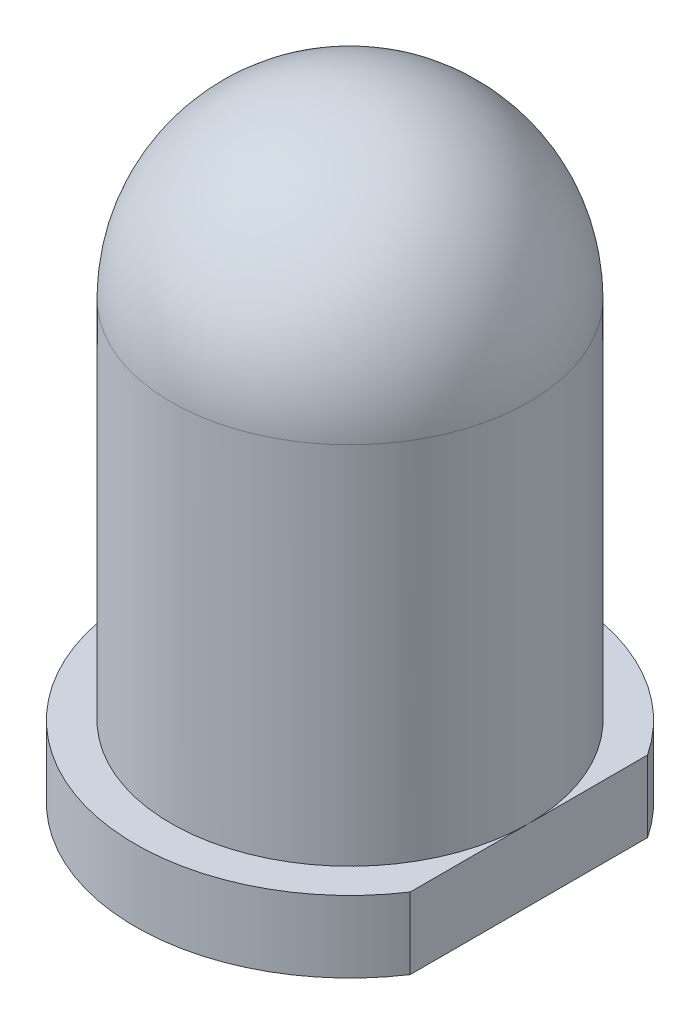
ISO-10303-21;
HEADER;
FILE_DESCRIPTION(('STEP AP214'),'2;1');
FILE_NAME('part.step','',(''),(''),'','','');
FILE_SCHEMA(('AUTOMOTIVE_DESIGN { 1 0 10303 214 1 1 1 1 }'));
ENDSEC;
DATA;
#1=APPLICATION_CONTEXT('core data for automotive mechanical design processes');
#2=APPLICATION_PROTOCOL_DEFINITION('international standard','automotive_design',2000,#1);
#3=PRODUCT_CONTEXT('',#1,'mechanical');
#4=PRODUCT('Part','Part','',(#3));
#5=PRODUCT_RELATED_PRODUCT_CATEGORY('part','',(#4));
#6=PRODUCT_DEFINITION_FORMATION('','',#4);
#7=PRODUCT_DEFINITION_CONTEXT('part definition',#1,'design');
#8=PRODUCT_DEFINITION('design','',#6,#7);
#9=PRODUCT_DEFINITION_SHAPE('','',#8);
#10=(LENGTH_UNIT() NAMED_UNIT(*) SI_UNIT(.MILLI.,.METRE.));
#11=(NAMED_UNIT(*) PLANE_ANGLE_UNIT() SI_UNIT($,.RADIAN.));
#12=(NAMED_UNIT(*) SI_UNIT($,.STERADIAN.) SOLID_ANGLE_UNIT());
#13=UNCERTAINTY_MEASURE_WITH_UNIT(LENGTH_MEASURE(1.E-05),#10,'distance_accuracy_value','');
#14=(GEOMETRIC_REPRESENTATION_CONTEXT(3) GLOBAL_UNCERTAINTY_ASSIGNED_CONTEXT((#13)) GLOBAL_UNIT_ASSIGNED_CONTEXT((#10,
#11,#12)) REPRESENTATION_CONTEXT('',''));
#15=CARTESIAN_POINT('',(0.,0.,0.));
#16=DIRECTION('',(0.,0.,1.));
#17=DIRECTION('',(1.,0.,0.));
#18=AXIS2_PLACEMENT_3D('',#15,#16,#17);
#19=CARTESIAN_POINT('',(0.,0.,0.));
#20=DIRECTION('',(0.,1.,0.));
#21=DIRECTION('',(0.,0.,1.));
#22=AXIS2_PLACEMENT_3D('',#19,#20,#21);
#23=PLANE('',#22);
#24=DIRECTION('',(0.,0.,1.));
#25=VECTOR('',#24,1.);
#26=CARTESIAN_POINT('',(2.49999999999997,-1.11022302462516E-13,-2.7251628373454));
#27=LINE('',#26,#25);
#28=CARTESIAN_POINT('',(2.49999999999999,0.,-1.65831239517771));
#29=VERTEX_POINT('',#28);
#30=CARTESIAN_POINT('',(2.50000000000002,0.,1.65831239517771));
#31=VERTEX_POINT('',#30);
#32=EDGE_CURVE('E65',#29,#31,#27,.T.);
#33=ORIENTED_EDGE('',*,*,#32,.T.);
#34=CARTESIAN_POINT('',(0.,0.,0.));
#35=DIRECTION('',(0.,-1.,0.));
#36=DIRECTION('',(0.,0.,-1.));
#37=AXIS2_PLACEMENT_3D('',#34,#35,#36);
#38=CIRCLE('',#37,3.);
#39=EDGE_CURVE('E11',#31,#29,#38,.T.);
#40=ORIENTED_EDGE('',*,*,#39,.T.);
#41=EDGE_LOOP('',(#33,#40));
#42=FACE_BOUND('',#41,.T.);
#43=ADVANCED_FACE('F38',(#42),#23,.F.);
#44=CARTESIAN_POINT('',(0.,0.,0.));
#45=DIRECTION('',(0.,-1.,0.));
#46=DIRECTION('',(0.,0.,-1.));
#47=AXIS2_PLACEMENT_3D('',#44,#45,#46);
#48=CYLINDRICAL_SURFACE('',#47,3.);
#49=DIRECTION('',(0.,-1.,0.));
#50=VECTOR('',#49,1.);
#51=CARTESIAN_POINT('',(2.50000000000002,0.,1.65831239517771));
#52=LINE('',#51,#50);
#53=CARTESIAN_POINT('',(2.49999999999999,0.999999999999973,1.65831239517775));
#54=VERTEX_POINT('',#53);
#55=EDGE_CURVE('E68',#54,#31,#52,.T.);
#56=ORIENTED_EDGE('',*,*,#55,.F.);
#57=CARTESIAN_POINT('',(0.,1.,0.));
#58=DIRECTION('',(0.,-1.,0.));
#59=DIRECTION('',(0.,0.,-1.));
#60=AXIS2_PLACEMENT_3D('',#57,#58,#59);
#61=CIRCLE('',#60,3.);
#62=CARTESIAN_POINT('',(2.49999999999993,0.999999999999945,-1.65831239517768));
#63=VERTEX_POINT('',#62);
#64=EDGE_CURVE('E45',#54,#63,#61,.T.);
#65=ORIENTED_EDGE('',*,*,#64,.T.);
#66=DIRECTION('',(0.,-1.,0.));
#67=VECTOR('',#66,1.);
#68=CARTESIAN_POINT('',(2.49999999999999,0.,-1.65831239517771));
#69=LINE('',#68,#67);
#70=EDGE_CURVE('E57',#29,#63,#69,.F.);
#71=ORIENTED_EDGE('',*,*,#70,.F.);
#72=ORIENTED_EDGE('',*,*,#39,.F.);
#73=EDGE_LOOP('',(#56,#65,#71,#72));
#74=FACE_BOUND('',#73,.T.);
#75=ADVANCED_FACE('F75',(#74),#48,.T.);
#76=CARTESIAN_POINT('',(-2.99999999999999,0.999999999999945,0.));
#77=DIRECTION('',(0.,-1.,0.));
#78=DIRECTION('',(0.,0.,-1.));
#79=AXIS2_PLACEMENT_3D('',#76,#77,#78);
#80=PLANE('',#79);
#81=DIRECTION('',(0.,0.,1.));
#82=VECTOR('',#81,1.);
#83=CARTESIAN_POINT('',(2.49999999999999,0.999999999999918,0.));
#84=LINE('',#83,#82);
#85=CARTESIAN_POINT('',(2.49999999999999,0.999999999999918,0.));
#86=VERTEX_POINT('',#85);
#87=EDGE_CURVE('E52',#63,#86,#84,.T.);
#88=ORIENTED_EDGE('',*,*,#87,.F.);
#89=ORIENTED_EDGE('',*,*,#64,.F.);
#90=EDGE_CURVE('E71',#86,#54,#84,.T.);
#91=ORIENTED_EDGE('',*,*,#90,.F.);
#92=CARTESIAN_POINT('',(0.,1.,0.));
#93=DIRECTION('',(0.,-1.,0.));
#94=DIRECTION('',(0.,0.,-1.));
#95=AXIS2_PLACEMENT_3D('',#92,#93,#94);
#96=CIRCLE('',#95,2.5);
#97=EDGE_CURVE('E122',#86,#86,#96,.T.);
#98=ORIENTED_EDGE('',*,*,#97,.T.);
#99=EDGE_LOOP('',(#88,#89,#91,#98));
#100=FACE_BOUND('',#99,.T.);
#101=ADVANCED_FACE('F83',(#100),#80,.F.);
#102=CARTESIAN_POINT('',(0.,0.,0.));
#103=DIRECTION('',(0.,-1.,0.));
#104=DIRECTION('',(0.,0.,-1.));
#105=AXIS2_PLACEMENT_3D('',#102,#103,#104);
#106=CYLINDRICAL_SURFACE('',#105,2.5);
#107=ORIENTED_EDGE('',*,*,#97,.F.);
#108=EDGE_LOOP('',(#107));
#109=FACE_BOUND('',#108,.T.);
#110=CARTESIAN_POINT('',(0.,6.09999999999997,0.));
#111=DIRECTION('',(0.,-1.,0.));
#112=DIRECTION('',(0.,0.,-1.));
#113=AXIS2_PLACEMENT_3D('',#110,#111,#112);
#114=CIRCLE('',#113,2.5);
#115=CARTESIAN_POINT('',(0.,6.09999999999997,-2.49999999999997));
#116=VERTEX_POINT('',#115);
#117=EDGE_CURVE('E77',#116,#116,#114,.T.);
#118=ORIENTED_EDGE('',*,*,#117,.T.);
#119=EDGE_LOOP('',(#118));
#120=FACE_BOUND('',#119,.T.);
#121=ADVANCED_FACE('F87',(#109,#120),#106,.T.);
#122=CARTESIAN_POINT('',(0.,6.09999999999997,0.));
#123=DIRECTION('',(0.,-1.,0.));
#124=DIRECTION('',(-1.,0.,0.));
#125=AXIS2_PLACEMENT_3D('',#122,#123,#124);
#126=SPHERICAL_SURFACE('',#125,2.5);
#127=ORIENTED_EDGE('',*,*,#117,.F.);
#128=EDGE_LOOP('',(#127));
#129=FACE_BOUND('',#128,.T.);
#130=ADVANCED_FACE('F93',(#129),#126,.T.);
#131=CARTESIAN_POINT('',(2.49999999999999,9.99999999999995,-2.72516283734535));
#132=DIRECTION('',(1.,0.,0.));
#133=DIRECTION('',(0.,0.,-1.));
#134=AXIS2_PLACEMENT_3D('',#131,#132,#133);
#135=PLANE('',#134);
#136=ORIENTED_EDGE('',*,*,#70,.T.);
#137=ORIENTED_EDGE('',*,*,#87,.T.);
#138=ORIENTED_EDGE('',*,*,#90,.T.);
#139=ORIENTED_EDGE('',*,*,#55,.T.);
#140=ORIENTED_EDGE('',*,*,#32,.F.);
#141=EDGE_LOOP('',(#136,#137,#138,#139,#140));
#142=FACE_BOUND('',#141,.T.);
#143=ADVANCED_FACE('F66',(#142),#135,.T.);
#144=CLOSED_SHELL('',(#43,#75,#101,#121,#130,#143));
#145=MANIFOLD_SOLID_BREP('B2',#144);
#146=ADVANCED_BREP_SHAPE_REPRESENTATION('',(#18,#145),#14);
#147=SHAPE_DEFINITION_REPRESENTATION(#9,#146);
ENDSEC;
END-ISO-10303-21;
